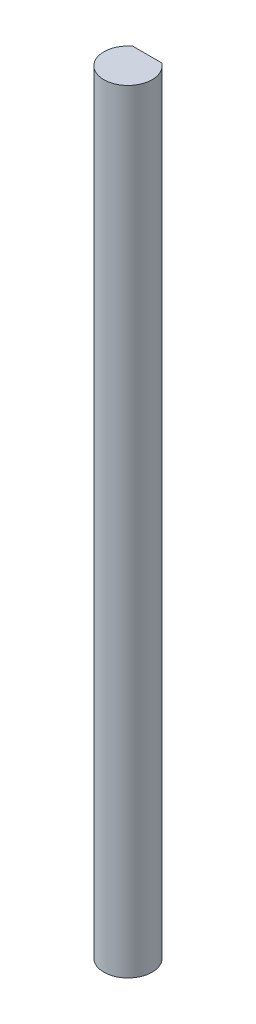
ISO-10303-21;
HEADER;
FILE_DESCRIPTION(('STEP AP214'),'2;1');
FILE_NAME('part.step','',(''),(''),'','','');
FILE_SCHEMA(('AUTOMOTIVE_DESIGN { 1 0 10303 214 1 1 1 1 }'));
ENDSEC;
DATA;
#1=APPLICATION_CONTEXT('core data for automotive mechanical design processes');
#2=APPLICATION_PROTOCOL_DEFINITION('international standard','automotive_design',2000,#1);
#3=PRODUCT_CONTEXT('',#1,'mechanical');
#4=PRODUCT('Part','Part','',(#3));
#5=PRODUCT_RELATED_PRODUCT_CATEGORY('part','',(#4));
#6=PRODUCT_DEFINITION_FORMATION('','',#4);
#7=PRODUCT_DEFINITION_CONTEXT('part definition',#1,'design');
#8=PRODUCT_DEFINITION('design','',#6,#7);
#9=PRODUCT_DEFINITION_SHAPE('','',#8);
#10=(LENGTH_UNIT() NAMED_UNIT(*) SI_UNIT(.MILLI.,.METRE.));
#11=(NAMED_UNIT(*) PLANE_ANGLE_UNIT() SI_UNIT($,.RADIAN.));
#12=(NAMED_UNIT(*) SI_UNIT($,.STERADIAN.) SOLID_ANGLE_UNIT());
#13=UNCERTAINTY_MEASURE_WITH_UNIT(LENGTH_MEASURE(1.E-05),#10,'distance_accuracy_value','');
#14=(GEOMETRIC_REPRESENTATION_CONTEXT(3) GLOBAL_UNCERTAINTY_ASSIGNED_CONTEXT((#13)) GLOBAL_UNIT_ASSIGNED_CONTEXT((#10,
#11,#12)) REPRESENTATION_CONTEXT('',''));
#15=CARTESIAN_POINT('',(0.,0.,0.));
#16=DIRECTION('',(0.,0.,1.));
#17=DIRECTION('',(1.,0.,0.));
#18=AXIS2_PLACEMENT_3D('',#15,#16,#17);
#19=CARTESIAN_POINT('',(0.,101.6,0.));
#20=DIRECTION('',(0.,-1.,0.));
#21=DIRECTION('',(0.,0.,-1.));
#22=AXIS2_PLACEMENT_3D('',#19,#20,#21);
#23=CYLINDRICAL_SURFACE('',#22,3.175);
#24=CARTESIAN_POINT('',(0.,0.,0.));
#25=DIRECTION('',(0.,1.,0.));
#26=DIRECTION('',(0.,0.,1.));
#27=AXIS2_PLACEMENT_3D('',#24,#25,#26);
#28=CIRCLE('',#27,3.175);
#29=CARTESIAN_POINT('',(-1.905,0.,-2.54));
#30=VERTEX_POINT('',#29);
#31=CARTESIAN_POINT('',(1.905,0.,-2.54));
#32=VERTEX_POINT('',#31);
#33=EDGE_CURVE('E64',#30,#32,#28,.T.);
#34=ORIENTED_EDGE('',*,*,#33,.T.);
#35=DIRECTION('',(0.,-1.,0.));
#36=VECTOR('',#35,1.);
#37=CARTESIAN_POINT('',(1.905,101.6,-2.54));
#38=LINE('',#37,#36);
#39=CARTESIAN_POINT('',(1.905,101.6,-2.54));
#40=VERTEX_POINT('',#39);
#41=EDGE_CURVE('E11',#40,#32,#38,.T.);
#42=ORIENTED_EDGE('',*,*,#41,.F.);
#43=CARTESIAN_POINT('',(0.,101.6,0.));
#44=DIRECTION('',(0.,1.,0.));
#45=DIRECTION('',(0.,0.,1.));
#46=AXIS2_PLACEMENT_3D('',#43,#44,#45);
#47=CIRCLE('',#46,3.175);
#48=CARTESIAN_POINT('',(-1.905,101.6,-2.54));
#49=VERTEX_POINT('',#48);
#50=EDGE_CURVE('E63',#49,#40,#47,.T.);
#51=ORIENTED_EDGE('',*,*,#50,.F.);
#52=DIRECTION('',(0.,-1.,0.));
#53=VECTOR('',#52,1.);
#54=CARTESIAN_POINT('',(-1.905,101.6,-2.54));
#55=LINE('',#54,#53);
#56=EDGE_CURVE('E41',#49,#30,#55,.T.);
#57=ORIENTED_EDGE('',*,*,#56,.T.);
#58=EDGE_LOOP('',(#34,#42,#51,#57));
#59=FACE_BOUND('',#58,.T.);
#60=ADVANCED_FACE('F33',(#59),#23,.T.);
#61=CARTESIAN_POINT('',(-1.905,101.6,-2.54));
#62=DIRECTION('',(0.,0.,1.));
#63=DIRECTION('',(1.,0.,0.));
#64=AXIS2_PLACEMENT_3D('',#61,#62,#63);
#65=PLANE('',#64);
#66=DIRECTION('',(-1.,0.,0.));
#67=VECTOR('',#66,1.);
#68=CARTESIAN_POINT('',(-1.905,0.,-2.54));
#69=LINE('',#68,#67);
#70=EDGE_CURVE('E56',#32,#30,#69,.T.);
#71=ORIENTED_EDGE('',*,*,#70,.T.);
#72=ORIENTED_EDGE('',*,*,#56,.F.);
#73=DIRECTION('',(-1.,0.,0.));
#74=VECTOR('',#73,1.);
#75=CARTESIAN_POINT('',(-1.905,101.6,-2.54));
#76=LINE('',#75,#74);
#77=EDGE_CURVE('E48',#40,#49,#76,.T.);
#78=ORIENTED_EDGE('',*,*,#77,.F.);
#79=ORIENTED_EDGE('',*,*,#41,.T.);
#80=EDGE_LOOP('',(#71,#72,#78,#79));
#81=FACE_BOUND('',#80,.T.);
#82=ADVANCED_FACE('F59',(#81),#65,.F.);
#83=CARTESIAN_POINT('',(0.,101.6,0.));
#84=DIRECTION('',(0.,1.,0.));
#85=DIRECTION('',(0.,0.,1.));
#86=AXIS2_PLACEMENT_3D('',#83,#84,#85);
#87=PLANE('',#86);
#88=ORIENTED_EDGE('',*,*,#50,.T.);
#89=ORIENTED_EDGE('',*,*,#77,.T.);
#90=EDGE_LOOP('',(#88,#89));
#91=FACE_BOUND('',#90,.T.);
#92=ADVANCED_FACE('F71',(#91),#87,.T.);
#93=CARTESIAN_POINT('',(0.,0.,0.));
#94=DIRECTION('',(0.,1.,0.));
#95=DIRECTION('',(0.,0.,1.));
#96=AXIS2_PLACEMENT_3D('',#93,#94,#95);
#97=PLANE('',#96);
#98=ORIENTED_EDGE('',*,*,#33,.F.);
#99=ORIENTED_EDGE('',*,*,#70,.F.);
#100=EDGE_LOOP('',(#98,#99));
#101=FACE_BOUND('',#100,.T.);
#102=ADVANCED_FACE('F67',(#101),#97,.F.);
#103=CLOSED_SHELL('',(#60,#82,#92,#102));
#104=MANIFOLD_SOLID_BREP('B2',#103);
#105=ADVANCED_BREP_SHAPE_REPRESENTATION('',(#18,#104),#14);
#106=SHAPE_DEFINITION_REPRESENTATION(#9,#105);
ENDSEC;
END-ISO-10303-21;
